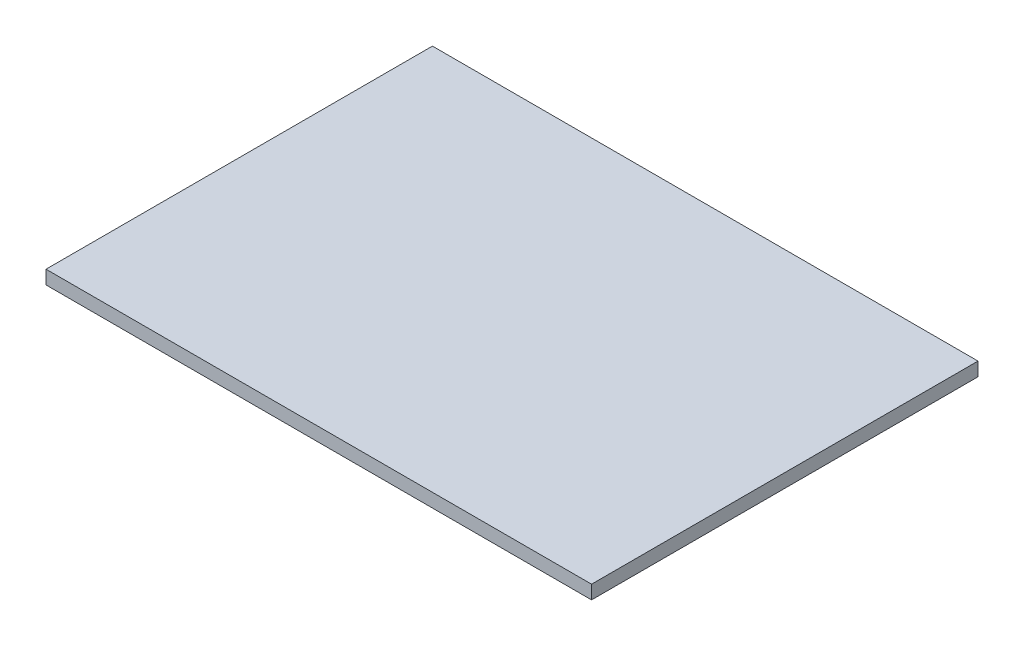
ISO-10303-21;
HEADER;
FILE_DESCRIPTION(('STEP AP214'),'2;1');
FILE_NAME('part.step','',(''),(''),'','','');
FILE_SCHEMA(('AUTOMOTIVE_DESIGN { 1 0 10303 214 1 1 1 1 }'));
ENDSEC;
DATA;
#1=APPLICATION_CONTEXT('core data for automotive mechanical design processes');
#2=APPLICATION_PROTOCOL_DEFINITION('international standard','automotive_design',2000,#1);
#3=PRODUCT_CONTEXT('',#1,'mechanical');
#4=PRODUCT('Part','Part','',(#3));
#5=PRODUCT_RELATED_PRODUCT_CATEGORY('part','',(#4));
#6=PRODUCT_DEFINITION_FORMATION('','',#4);
#7=PRODUCT_DEFINITION_CONTEXT('part definition',#1,'design');
#8=PRODUCT_DEFINITION('design','',#6,#7);
#9=PRODUCT_DEFINITION_SHAPE('','',#8);
#10=(LENGTH_UNIT() NAMED_UNIT(*) SI_UNIT(.MILLI.,.METRE.));
#11=(NAMED_UNIT(*) PLANE_ANGLE_UNIT() SI_UNIT($,.RADIAN.));
#12=(NAMED_UNIT(*) SI_UNIT($,.STERADIAN.) SOLID_ANGLE_UNIT());
#13=UNCERTAINTY_MEASURE_WITH_UNIT(LENGTH_MEASURE(1.E-05),#10,'distance_accuracy_value','');
#14=(GEOMETRIC_REPRESENTATION_CONTEXT(3) GLOBAL_UNCERTAINTY_ASSIGNED_CONTEXT((#13)) GLOBAL_UNIT_ASSIGNED_CONTEXT((#10,
#11,#12)) REPRESENTATION_CONTEXT('',''));
#15=CARTESIAN_POINT('',(0.,0.,0.));
#16=DIRECTION('',(0.,0.,1.));
#17=DIRECTION('',(1.,0.,0.));
#18=AXIS2_PLACEMENT_3D('',#15,#16,#17);
#19=CARTESIAN_POINT('',(60.,3.,-42.5));
#20=DIRECTION('',(-1.,0.,0.));
#21=DIRECTION('',(0.,0.,1.));
#22=AXIS2_PLACEMENT_3D('',#19,#20,#21);
#23=PLANE('',#22);
#24=DIRECTION('',(0.,0.,-1.));
#25=VECTOR('',#24,1.);
#26=CARTESIAN_POINT('',(60.,0.,-42.5));
#27=LINE('',#26,#25);
#28=CARTESIAN_POINT('',(60.,0.,42.5));
#29=VERTEX_POINT('',#28);
#30=CARTESIAN_POINT('',(60.,0.,-42.5));
#31=VERTEX_POINT('',#30);
#32=EDGE_CURVE('E98',#29,#31,#27,.T.);
#33=ORIENTED_EDGE('',*,*,#32,.T.);
#34=DIRECTION('',(0.,-1.,0.));
#35=VECTOR('',#34,1.);
#36=CARTESIAN_POINT('',(60.,3.,-42.5));
#37=LINE('',#36,#35);
#38=CARTESIAN_POINT('',(60.,3.,-42.5));
#39=VERTEX_POINT('',#38);
#40=EDGE_CURVE('E11',#39,#31,#37,.T.);
#41=ORIENTED_EDGE('',*,*,#40,.F.);
#42=DIRECTION('',(0.,0.,-1.));
#43=VECTOR('',#42,1.);
#44=CARTESIAN_POINT('',(60.,3.,-42.5));
#45=LINE('',#44,#43);
#46=CARTESIAN_POINT('',(60.,3.,42.5));
#47=VERTEX_POINT('',#46);
#48=EDGE_CURVE('E86',#47,#39,#45,.T.);
#49=ORIENTED_EDGE('',*,*,#48,.F.);
#50=DIRECTION('',(0.,-1.,0.));
#51=VECTOR('',#50,1.);
#52=CARTESIAN_POINT('',(60.,3.,42.5));
#53=LINE('',#52,#51);
#54=EDGE_CURVE('E94',#47,#29,#53,.T.);
#55=ORIENTED_EDGE('',*,*,#54,.T.);
#56=EDGE_LOOP('',(#33,#41,#49,#55));
#57=FACE_BOUND('',#56,.T.);
#58=ADVANCED_FACE('F35',(#57),#23,.F.);
#59=CARTESIAN_POINT('',(-60.,3.,-42.5));
#60=DIRECTION('',(0.,0.,1.));
#61=DIRECTION('',(1.,0.,0.));
#62=AXIS2_PLACEMENT_3D('',#59,#60,#61);
#63=PLANE('',#62);
#64=DIRECTION('',(-1.,0.,0.));
#65=VECTOR('',#64,1.);
#66=CARTESIAN_POINT('',(-60.,0.,-42.5));
#67=LINE('',#66,#65);
#68=CARTESIAN_POINT('',(-60.,0.,-42.5));
#69=VERTEX_POINT('',#68);
#70=EDGE_CURVE('E90',#31,#69,#67,.T.);
#71=ORIENTED_EDGE('',*,*,#70,.T.);
#72=DIRECTION('',(0.,-1.,0.));
#73=VECTOR('',#72,1.);
#74=CARTESIAN_POINT('',(-60.,3.,-42.5));
#75=LINE('',#74,#73);
#76=CARTESIAN_POINT('',(-60.,3.,-42.5));
#77=VERTEX_POINT('',#76);
#78=EDGE_CURVE('E43',#77,#69,#75,.T.);
#79=ORIENTED_EDGE('',*,*,#78,.F.);
#80=DIRECTION('',(-1.,0.,0.));
#81=VECTOR('',#80,1.);
#82=CARTESIAN_POINT('',(-60.,3.,-42.5));
#83=LINE('',#82,#81);
#84=EDGE_CURVE('E81',#39,#77,#83,.T.);
#85=ORIENTED_EDGE('',*,*,#84,.F.);
#86=ORIENTED_EDGE('',*,*,#40,.T.);
#87=EDGE_LOOP('',(#71,#79,#85,#86));
#88=FACE_BOUND('',#87,.T.);
#89=ADVANCED_FACE('F89',(#88),#63,.F.);
#90=CARTESIAN_POINT('',(-60.,3.,-42.5));
#91=DIRECTION('',(1.,0.,0.));
#92=DIRECTION('',(0.,0.,-1.));
#93=AXIS2_PLACEMENT_3D('',#90,#91,#92);
#94=PLANE('',#93);
#95=DIRECTION('',(0.,0.,1.));
#96=VECTOR('',#95,1.);
#97=CARTESIAN_POINT('',(-60.,0.,-42.5));
#98=LINE('',#97,#96);
#99=CARTESIAN_POINT('',(-60.,0.,42.5));
#100=VERTEX_POINT('',#99);
#101=EDGE_CURVE('E68',#69,#100,#98,.T.);
#102=ORIENTED_EDGE('',*,*,#101,.T.);
#103=DIRECTION('',(0.,-1.,0.));
#104=VECTOR('',#103,1.);
#105=CARTESIAN_POINT('',(-60.,3.,42.5));
#106=LINE('',#105,#104);
#107=CARTESIAN_POINT('',(-60.,3.,42.5));
#108=VERTEX_POINT('',#107);
#109=EDGE_CURVE('E91',#108,#100,#106,.T.);
#110=ORIENTED_EDGE('',*,*,#109,.F.);
#111=DIRECTION('',(0.,0.,1.));
#112=VECTOR('',#111,1.);
#113=CARTESIAN_POINT('',(-60.,3.,-42.5));
#114=LINE('',#113,#112);
#115=EDGE_CURVE('E84',#77,#108,#114,.T.);
#116=ORIENTED_EDGE('',*,*,#115,.F.);
#117=ORIENTED_EDGE('',*,*,#78,.T.);
#118=EDGE_LOOP('',(#102,#110,#116,#117));
#119=FACE_BOUND('',#118,.T.);
#120=ADVANCED_FACE('F92',(#119),#94,.F.);
#121=CARTESIAN_POINT('',(-60.,3.,42.5));
#122=DIRECTION('',(0.,0.,-1.));
#123=DIRECTION('',(-1.,0.,0.));
#124=AXIS2_PLACEMENT_3D('',#121,#122,#123);
#125=PLANE('',#124);
#126=DIRECTION('',(1.,0.,0.));
#127=VECTOR('',#126,1.);
#128=CARTESIAN_POINT('',(-60.,0.,42.5));
#129=LINE('',#128,#127);
#130=EDGE_CURVE('E74',#100,#29,#129,.T.);
#131=ORIENTED_EDGE('',*,*,#130,.T.);
#132=ORIENTED_EDGE('',*,*,#54,.F.);
#133=DIRECTION('',(1.,0.,0.));
#134=VECTOR('',#133,1.);
#135=CARTESIAN_POINT('',(-60.,3.,42.5));
#136=LINE('',#135,#134);
#137=EDGE_CURVE('E51',#108,#47,#136,.T.);
#138=ORIENTED_EDGE('',*,*,#137,.F.);
#139=ORIENTED_EDGE('',*,*,#109,.T.);
#140=EDGE_LOOP('',(#131,#132,#138,#139));
#141=FACE_BOUND('',#140,.T.);
#142=ADVANCED_FACE('F105',(#141),#125,.F.);
#143=CARTESIAN_POINT('',(0.,3.,0.));
#144=DIRECTION('',(0.,1.,0.));
#145=DIRECTION('',(0.,0.,1.));
#146=AXIS2_PLACEMENT_3D('',#143,#144,#145);
#147=PLANE('',#146);
#148=ORIENTED_EDGE('',*,*,#48,.T.);
#149=ORIENTED_EDGE('',*,*,#84,.T.);
#150=ORIENTED_EDGE('',*,*,#115,.T.);
#151=ORIENTED_EDGE('',*,*,#137,.T.);
#152=EDGE_LOOP('',(#148,#149,#150,#151));
#153=FACE_BOUND('',#152,.T.);
#154=ADVANCED_FACE('F82',(#153),#147,.T.);
#155=CARTESIAN_POINT('',(0.,0.,0.));
#156=DIRECTION('',(0.,1.,0.));
#157=DIRECTION('',(0.,0.,1.));
#158=AXIS2_PLACEMENT_3D('',#155,#156,#157);
#159=PLANE('',#158);
#160=ORIENTED_EDGE('',*,*,#32,.F.);
#161=ORIENTED_EDGE('',*,*,#130,.F.);
#162=ORIENTED_EDGE('',*,*,#101,.F.);
#163=ORIENTED_EDGE('',*,*,#70,.F.);
#164=EDGE_LOOP('',(#160,#161,#162,#163));
#165=FACE_BOUND('',#164,.T.);
#166=ADVANCED_FACE('F108',(#165),#159,.F.);
#167=CLOSED_SHELL('',(#58,#89,#120,#142,#154,#166));
#168=MANIFOLD_SOLID_BREP('B2',#167);
#169=ADVANCED_BREP_SHAPE_REPRESENTATION('',(#18,#168),#14);
#170=SHAPE_DEFINITION_REPRESENTATION(#9,#169);
ENDSEC;
END-ISO-10303-21;
